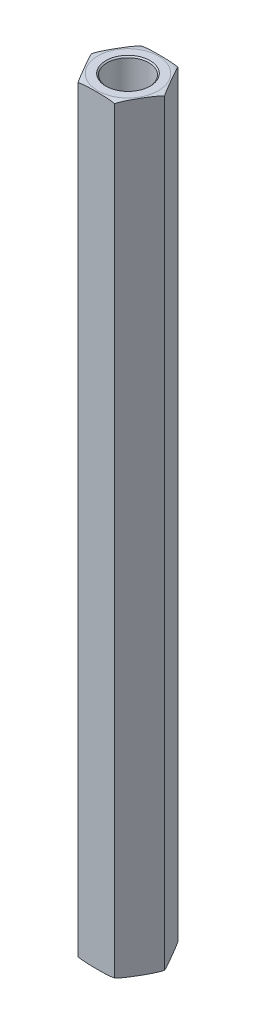
ISO-10303-21;
HEADER;
FILE_DESCRIPTION(('STEP AP214'),'2;1');
FILE_NAME('part.step','',(''),(''),'','','');
FILE_SCHEMA(('AUTOMOTIVE_DESIGN { 1 0 10303 214 1 1 1 1 }'));
ENDSEC;
DATA;
#1=APPLICATION_CONTEXT('core data for automotive mechanical design processes');
#2=APPLICATION_PROTOCOL_DEFINITION('international standard','automotive_design',2000,#1);
#3=PRODUCT_CONTEXT('',#1,'mechanical');
#4=PRODUCT('Part','Part','',(#3));
#5=PRODUCT_RELATED_PRODUCT_CATEGORY('part','',(#4));
#6=PRODUCT_DEFINITION_FORMATION('','',#4);
#7=PRODUCT_DEFINITION_CONTEXT('part definition',#1,'design');
#8=PRODUCT_DEFINITION('design','',#6,#7);
#9=PRODUCT_DEFINITION_SHAPE('','',#8);
#10=(LENGTH_UNIT() NAMED_UNIT(*) SI_UNIT(.MILLI.,.METRE.));
#11=(NAMED_UNIT(*) PLANE_ANGLE_UNIT() SI_UNIT($,.RADIAN.));
#12=(NAMED_UNIT(*) SI_UNIT($,.STERADIAN.) SOLID_ANGLE_UNIT());
#13=UNCERTAINTY_MEASURE_WITH_UNIT(LENGTH_MEASURE(1.E-05),#10,'distance_accuracy_value','');
#14=(GEOMETRIC_REPRESENTATION_CONTEXT(3) GLOBAL_UNCERTAINTY_ASSIGNED_CONTEXT((#13)) GLOBAL_UNIT_ASSIGNED_CONTEXT((#10,
#11,#12)) REPRESENTATION_CONTEXT('',''));
#15=CARTESIAN_POINT('',(0.,0.,0.));
#16=DIRECTION('',(0.,0.,1.));
#17=DIRECTION('',(1.,0.,0.));
#18=AXIS2_PLACEMENT_3D('',#15,#16,#17);
#19=CARTESIAN_POINT('',(0.,25.4,0.));
#20=DIRECTION('',(0.,1.,0.));
#21=DIRECTION('',(0.,0.,1.));
#22=AXIS2_PLACEMENT_3D('',#19,#20,#21);
#23=PLANE('',#22);
#24=CARTESIAN_POINT('',(0.,25.4,0.));
#25=DIRECTION('',(0.,1.,0.));
#26=DIRECTION('',(0.,0.,1.));
#27=AXIS2_PLACEMENT_3D('',#24,#25,#26);
#28=CIRCLE('',#27,2.0955);
#29=CARTESIAN_POINT('',(0.,25.4,2.0955));
#30=VERTEX_POINT('',#29);
#31=EDGE_CURVE('E302',#30,#30,#28,.T.);
#32=ORIENTED_EDGE('',*,*,#31,.T.);
#33=EDGE_LOOP('',(#32));
#34=FACE_BOUND('',#33,.T.);
#35=ADVANCED_FACE('F16',(#34),#23,.T.);
#36=CARTESIAN_POINT('',(0.,-25.4,0.));
#37=DIRECTION('',(0.,-1.,0.));
#38=DIRECTION('',(0.,0.,-1.));
#39=AXIS2_PLACEMENT_3D('',#36,#37,#38);
#40=PLANE('',#39);
#41=CARTESIAN_POINT('',(0.,-25.4,0.));
#42=DIRECTION('',(0.,-1.,0.));
#43=DIRECTION('',(0.,0.,-1.));
#44=AXIS2_PLACEMENT_3D('',#41,#42,#43);
#45=CIRCLE('',#44,2.0955);
#46=CARTESIAN_POINT('',(0.,-25.4,-2.0955));
#47=VERTEX_POINT('',#46);
#48=EDGE_CURVE('E312',#47,#47,#45,.T.);
#49=ORIENTED_EDGE('',*,*,#48,.T.);
#50=EDGE_LOOP('',(#49));
#51=FACE_BOUND('',#50,.T.);
#52=ADVANCED_FACE('F407',(#51),#40,.T.);
#53=CARTESIAN_POINT('',(0.,25.4,0.));
#54=DIRECTION('',(0.,1.,0.));
#55=DIRECTION('',(0.,0.,1.));
#56=AXIS2_PLACEMENT_3D('',#53,#54,#55);
#57=CYLINDRICAL_SURFACE('',#56,2.0955);
#58=CARTESIAN_POINT('',(0.,37.9730000000222,0.));
#59=DIRECTION('',(0.,1.,0.));
#60=DIRECTION('',(0.,0.,1.));
#61=AXIS2_PLACEMENT_3D('',#58,#59,#60);
#62=CIRCLE('',#61,2.09549999999581);
#63=CARTESIAN_POINT('',(0.,37.9730000000222,2.09549999999581));
#64=VERTEX_POINT('',#63);
#65=EDGE_CURVE('E314',#64,#64,#62,.T.);
#66=ORIENTED_EDGE('',*,*,#65,.T.);
#67=EDGE_LOOP('',(#66));
#68=FACE_BOUND('',#67,.T.);
#69=ORIENTED_EDGE('',*,*,#31,.F.);
#70=EDGE_LOOP('',(#69));
#71=FACE_BOUND('',#70,.T.);
#72=ADVANCED_FACE('F324',(#68,#71),#57,.F.);
#73=CARTESIAN_POINT('',(0.,-25.4,0.));
#74=DIRECTION('',(0.,-1.,0.));
#75=DIRECTION('',(0.,0.,-1.));
#76=AXIS2_PLACEMENT_3D('',#73,#74,#75);
#77=CYLINDRICAL_SURFACE('',#76,2.0955);
#78=ORIENTED_EDGE('',*,*,#48,.F.);
#79=EDGE_LOOP('',(#78));
#80=FACE_BOUND('',#79,.T.);
#81=CARTESIAN_POINT('',(0.,-37.9729999999654,0.));
#82=DIRECTION('',(0.,-1.,0.));
#83=DIRECTION('',(0.,0.,-1.));
#84=AXIS2_PLACEMENT_3D('',#81,#82,#83);
#85=CIRCLE('',#84,2.09549999999581);
#86=CARTESIAN_POINT('',(0.,-37.9729999999654,-2.09549999999581));
#87=VERTEX_POINT('',#86);
#88=EDGE_CURVE('E154',#87,#87,#85,.T.);
#89=ORIENTED_EDGE('',*,*,#88,.T.);
#90=EDGE_LOOP('',(#89));
#91=FACE_BOUND('',#90,.T.);
#92=ADVANCED_FACE('F329',(#80,#91),#77,.F.);
#93=CARTESIAN_POINT('',(0.,38.099999999929,0.));
#94=DIRECTION('',(0.,1.,0.));
#95=DIRECTION('',(0.,0.,1.));
#96=AXIS2_PLACEMENT_3D('',#93,#94,#95);
#97=CONICAL_SURFACE('',#96,2.22249999990254,0.785398163397448);
#98=CARTESIAN_POINT('',(0.,38.1000000000427,0.));
#99=DIRECTION('',(0.,1.,0.));
#100=DIRECTION('',(0.,0.,1.));
#101=AXIS2_PLACEMENT_3D('',#98,#99,#100);
#102=CIRCLE('',#101,2.22250000001623);
#103=CARTESIAN_POINT('',(0.,38.1000000000427,2.22250000001623));
#104=VERTEX_POINT('',#103);
#105=EDGE_CURVE('E79',#104,#104,#102,.T.);
#106=ORIENTED_EDGE('',*,*,#105,.T.);
#107=EDGE_LOOP('',(#106));
#108=FACE_BOUND('',#107,.T.);
#109=ORIENTED_EDGE('',*,*,#65,.F.);
#110=EDGE_LOOP('',(#109));
#111=FACE_BOUND('',#110,.T.);
#112=ADVANCED_FACE('F327',(#108,#111),#97,.F.);
#113=CARTESIAN_POINT('',(-3.66617420935413,38.1,0.));
#114=DIRECTION('',(0.866025403784439,0.,-0.499999999999999));
#115=DIRECTION('',(-0.499999999999999,0.,-0.866025403784439));
#116=AXIS2_PLACEMENT_3D('',#113,#114,#115);
#117=PLANE('',#116);
#118=DIRECTION('',(0.,1.,0.));
#119=VECTOR('',#118,1.);
#120=CARTESIAN_POINT('',(-1.83308710467708,38.1,3.175));
#121=LINE('',#120,#119);
#122=CARTESIAN_POINT('',(-1.83308710467708,-37.973,3.17499999999999));
#123=VERTEX_POINT('',#122);
#124=CARTESIAN_POINT('',(-1.83308710467706,37.973,3.175));
#125=VERTEX_POINT('',#124);
#126=EDGE_CURVE('E75',#123,#125,#121,.T.);
#127=ORIENTED_EDGE('',*,*,#126,.T.);
#128=CARTESIAN_POINT('',(-3.66617420935412,37.973,0.));
#129=CARTESIAN_POINT('',(-3.62797961467394,37.9889014148997,0.0661549785605816));
#130=CARTESIAN_POINT('',(-3.58956810864155,38.0024886076105,0.132685658603915));
#131=CARTESIAN_POINT('',(-3.51249051795707,38.0258161979402,0.266187961794431));
#132=CARTESIAN_POINT('',(-3.47382473049842,38.0355604771397,0.333159070187479));
#133=CARTESIAN_POINT('',(-3.39641631867867,38.0519966530451,0.467234372392503));
#134=CARTESIAN_POINT('',(-3.35767399633305,38.0586945328669,0.534338043098323));
#135=CARTESIAN_POINT('',(-3.28009834620104,38.0697767572932,0.668703010557154));
#136=CARTESIAN_POINT('',(-3.24126499587761,38.074160450474,0.735964346345458));
#137=CARTESIAN_POINT('',(-3.16354065964303,38.0812403004263,0.870586845688321));
#138=CARTESIAN_POINT('',(-3.12464965374463,38.0839355237591,0.937948043861809));
#139=CARTESIAN_POINT('',(-3.04685144594578,38.0881531983713,1.07269849250722));
#140=CARTESIAN_POINT('',(-3.00794424351953,38.0896756080272,1.14008774388984));
#141=CARTESIAN_POINT('',(-2.93051517598855,38.091922705889,1.27419882283618));
#142=CARTESIAN_POINT('',(-2.89199336248915,38.0926552468181,1.34092056101683));
#143=CARTESIAN_POINT('',(-2.81494778346123,38.0935767302574,1.47436741839176));
#144=CARTESIAN_POINT('',(-2.77642401791417,38.0937656658949,1.54109253761813));
#145=CARTESIAN_POINT('',(-2.69935964430989,38.0936659966806,1.67457194815423));
#146=CARTESIAN_POINT('',(-2.66081903631797,38.0933771811765,1.74132623935083));
#147=CARTESIAN_POINT('',(-2.58373908085303,38.092221986219,1.87483263846124));
#148=CARTESIAN_POINT('',(-2.54519973341218,38.0913555970386,1.94158474631935));
#149=CARTESIAN_POINT('',(-2.46812969629742,38.0887861940656,2.07507396634334));
#150=CARTESIAN_POINT('',(-2.42959900625935,38.0870832271616,2.14181107913996));
#151=CARTESIAN_POINT('',(-2.35255651340877,38.0824387229726,2.27525259109893));
#152=CARTESIAN_POINT('',(-2.3140447097541,38.0794972471358,2.34195699171993));
#153=CARTESIAN_POINT('',(-2.25084206239913,38.0732174124748,2.4514271881116));
#154=CARTESIAN_POINT('',(-2.2261384933698,38.0703980110463,2.49421502479868));
#155=CARTESIAN_POINT('',(-2.17676945272202,38.0638696794303,2.57972471152158));
#156=CARTESIAN_POINT('',(-2.15210397034159,38.0601610809139,2.62244658019767));
#157=CARTESIAN_POINT('',(-2.10282753811676,38.0516802711496,2.70779586442681));
#158=CARTESIAN_POINT('',(-2.07821657107511,38.0469084657008,2.75042330976635));
#159=CARTESIAN_POINT('',(-2.02900094683535,38.0360987712516,2.83566727147582));
#160=CARTESIAN_POINT('',(-2.00439646085451,38.0300577313084,2.87828349128876));
#161=CARTESIAN_POINT('',(-1.95527325900925,38.0165138354161,2.96336737271521));
#162=CARTESIAN_POINT('',(-1.93075459617607,38.0090101978029,3.00583494247592));
#163=CARTESIAN_POINT('',(-1.88182157373168,37.9923203507084,3.09058942351751));
#164=CARTESIAN_POINT('',(-1.85740744053269,37.9831314978033,3.13287594264093));
#165=CARTESIAN_POINT('',(-1.83308710467707,37.973,3.175));
#166=B_SPLINE_CURVE_WITH_KNOTS('',3,(#128,#129,#130,#131,#132,#133,#134,#135,#136,#137,#138,
#139,#140,#141,#142,#143,#144,#145,#146,#147,#148,#149,#150,#151,#152,#153,#154,#155,#156,#157,
#158,#159,#160,#161,#162,#163,#164,#165),.UNSPECIFIED.,.F.,.F.,(4,2,2,2,2,2,2,2,2,2,2,2,2,2,2,2,
2,2,4),(0.,0.233977307817999,0.467717675040806,0.700996973557669,0.934341903229975,
1.16781571967268,1.40129782179858,1.63243665809709,1.86357841666662,2.09482211846345,
2.32606971471551,2.55730435147459,2.7885275169448,2.93698369265143,3.08538458004518,
3.23372892334618,3.38244598546634,3.53124274626094,3.68027493713584),.UNSPECIFIED.);
#167=CARTESIAN_POINT('',(-3.66617420935412,37.973,0.));
#168=VERTEX_POINT('',#167);
#169=EDGE_CURVE('E68',#168,#125,#166,.T.);
#170=ORIENTED_EDGE('',*,*,#169,.F.);
#171=DIRECTION('',(0.,1.,0.));
#172=VECTOR('',#171,1.);
#173=CARTESIAN_POINT('',(-3.66617420935413,38.1,0.));
#174=LINE('',#173,#172);
#175=CARTESIAN_POINT('',(-3.66617420935413,-37.973,0.));
#176=VERTEX_POINT('',#175);
#177=EDGE_CURVE('E72',#168,#176,#174,.F.);
#178=ORIENTED_EDGE('',*,*,#177,.T.);
#179=CARTESIAN_POINT('',(-1.83308710467707,-37.973,3.17499999999999));
#180=CARTESIAN_POINT('',(-1.87128169935726,-37.9889014148997,3.10884502143941));
#181=CARTESIAN_POINT('',(-1.90969320538964,-38.0024886076105,3.04231434139608));
#182=CARTESIAN_POINT('',(-1.98677079607412,-38.0258161979402,2.90881203820556));
#183=CARTESIAN_POINT('',(-2.02543658353278,-38.0355604771397,2.84184092981252));
#184=CARTESIAN_POINT('',(-2.10284499535253,-38.0519966530451,2.70776562760749));
#185=CARTESIAN_POINT('',(-2.14158731769815,-38.0586945328669,2.64066195690167));
#186=CARTESIAN_POINT('',(-2.21916296783016,-38.0697767572932,2.50629698944284));
#187=CARTESIAN_POINT('',(-2.25799631815359,-38.074160450474,2.43903565365454));
#188=CARTESIAN_POINT('',(-2.33572065438817,-38.0812403004263,2.30441315431167));
#189=CARTESIAN_POINT('',(-2.37461166028657,-38.0839355237591,2.23705195613819));
#190=CARTESIAN_POINT('',(-2.45240986808542,-38.0881531983713,2.10230150749278));
#191=CARTESIAN_POINT('',(-2.49131707051166,-38.0896756080272,2.03491225611015));
#192=CARTESIAN_POINT('',(-2.56874613804264,-38.091922705889,1.90080117716381));
#193=CARTESIAN_POINT('',(-2.60726795154204,-38.0926552468181,1.83407943898316));
#194=CARTESIAN_POINT('',(-2.68431353056997,-38.0935767302574,1.70063258160823));
#195=CARTESIAN_POINT('',(-2.72283729611702,-38.0937656658949,1.63390746238186));
#196=CARTESIAN_POINT('',(-2.79990166972131,-38.0936659966806,1.50042805184577));
#197=CARTESIAN_POINT('',(-2.83844227771323,-38.0933771811765,1.43367376064917));
#198=CARTESIAN_POINT('',(-2.91552223317816,-38.092221986219,1.30016736153875));
#199=CARTESIAN_POINT('',(-2.95406158061902,-38.0913555970386,1.23341525368064));
#200=CARTESIAN_POINT('',(-3.03113161773378,-38.0887861940656,1.09992603365665));
#201=CARTESIAN_POINT('',(-3.06966230777185,-38.0870832271616,1.03318892086004));
#202=CARTESIAN_POINT('',(-3.14670480062243,-38.0824387229726,0.899747408901061));
#203=CARTESIAN_POINT('',(-3.1852166042771,-38.0794972471358,0.833043008280059));
#204=CARTESIAN_POINT('',(-3.24841925163207,-38.0732174124748,0.723572811888393));
#205=CARTESIAN_POINT('',(-3.27312282066139,-38.0703980110463,0.680784975201311));
#206=CARTESIAN_POINT('',(-3.32249186130918,-38.0638696794303,0.595275288478418));
#207=CARTESIAN_POINT('',(-3.3471573436896,-38.0601610809139,0.552553419802327));
#208=CARTESIAN_POINT('',(-3.39643377591444,-38.0516802711496,0.467204135573185));
#209=CARTESIAN_POINT('',(-3.42104474295609,-38.0469084657008,0.424576690233643));
#210=CARTESIAN_POINT('',(-3.47026036719584,-38.0360987712516,0.339332728524168));
#211=CARTESIAN_POINT('',(-3.49486485317669,-38.0300577313084,0.296716508711231));
#212=CARTESIAN_POINT('',(-3.54398805502195,-38.0165138354161,0.211632627284777));
#213=CARTESIAN_POINT('',(-3.56850671785512,-38.0090101978029,0.169165057524069));
#214=CARTESIAN_POINT('',(-3.61743974029951,-37.9923203507084,0.0844105764824764));
#215=CARTESIAN_POINT('',(-3.64185387349851,-37.9831314978033,0.0421240573590603));
#216=CARTESIAN_POINT('',(-3.66617420935413,-37.973,0.));
#217=B_SPLINE_CURVE_WITH_KNOTS('',3,(#179,#180,#181,#182,#183,#184,#185,#186,#187,#188,#189,
#190,#191,#192,#193,#194,#195,#196,#197,#198,#199,#200,#201,#202,#203,#204,#205,#206,#207,#208,
#209,#210,#211,#212,#213,#214,#215,#216),.UNSPECIFIED.,.F.,.F.,(4,2,2,2,2,2,2,2,2,2,2,2,2,2,2,2,
2,2,4),(0.,0.233977307817998,0.467717675040806,0.700996973557669,0.934341903229975,
1.16781571967268,1.40129782179858,1.63243665809709,1.86357841666662,2.09482211846345,
2.32606971471551,2.55730435147459,2.7885275169448,2.93698369265143,3.08538458004518,
3.23372892334618,3.38244598546635,3.53124274626094,3.68027493713584),.UNSPECIFIED.);
#218=EDGE_CURVE('E87',#123,#176,#217,.T.);
#219=ORIENTED_EDGE('',*,*,#218,.F.);
#220=EDGE_LOOP('',(#127,#170,#178,#219));
#221=FACE_BOUND('',#220,.T.);
#222=ADVANCED_FACE('F70',(#221),#117,.F.);
#223=CARTESIAN_POINT('',(0.,-38.0999999998153,0.));
#224=DIRECTION('',(0.,-1.,0.));
#225=DIRECTION('',(0.,0.,-1.));
#226=AXIS2_PLACEMENT_3D('',#223,#224,#225);
#227=CONICAL_SURFACE('',#226,2.2224999998457,0.785398163397448);
#228=ORIENTED_EDGE('',*,*,#88,.F.);
#229=EDGE_LOOP('',(#228));
#230=FACE_BOUND('',#229,.T.);
#231=CARTESIAN_POINT('',(0.,-38.099999999929,0.));
#232=DIRECTION('',(0.,-1.,0.));
#233=DIRECTION('',(0.,0.,-1.));
#234=AXIS2_PLACEMENT_3D('',#231,#232,#233);
#235=CIRCLE('',#234,2.22249999995938);
#236=CARTESIAN_POINT('',(0.,-38.099999999929,-2.22249999995938));
#237=VERTEX_POINT('',#236);
#238=EDGE_CURVE('E278',#237,#237,#235,.F.);
#239=ORIENTED_EDGE('',*,*,#238,.F.);
#240=EDGE_LOOP('',(#239));
#241=FACE_BOUND('',#240,.T.);
#242=ADVANCED_FACE('F336',(#230,#241),#227,.F.);
#243=CARTESIAN_POINT('',(-1.83308710467707,38.1,-3.175));
#244=DIRECTION('',(0.,-1.,0.));
#245=DIRECTION('',(0.,0.,-1.));
#246=AXIS2_PLACEMENT_3D('',#243,#244,#245);
#247=PLANE('',#246);
#248=CARTESIAN_POINT('',(0.,38.1,0.));
#249=DIRECTION('',(0.,-1.,0.));
#250=DIRECTION('',(0.,0.,1.));
#251=AXIS2_PLACEMENT_3D('',#248,#249,#250);
#252=CIRCLE('',#251,3.03117420935412);
#253=CARTESIAN_POINT('',(0.,38.1,3.03117420935411));
#254=VERTEX_POINT('',#253);
#255=CARTESIAN_POINT('',(0.,38.1,-3.03117420935411));
#256=VERTEX_POINT('',#255);
#257=EDGE_CURVE('E78',#254,#256,#252,.T.);
#258=ORIENTED_EDGE('',*,*,#257,.F.);
#259=CARTESIAN_POINT('',(0.,38.1,0.));
#260=DIRECTION('',(0.,-1.,0.));
#261=DIRECTION('',(0.,0.,-1.));
#262=AXIS2_PLACEMENT_3D('',#259,#260,#261);
#263=CIRCLE('',#262,3.03117420935412);
#264=EDGE_CURVE('E139',#256,#254,#263,.T.);
#265=ORIENTED_EDGE('',*,*,#264,.F.);
#266=EDGE_LOOP('',(#258,#265));
#267=FACE_BOUND('',#266,.T.);
#268=ORIENTED_EDGE('',*,*,#105,.F.);
#269=EDGE_LOOP('',(#268));
#270=FACE_BOUND('',#269,.T.);
#271=ADVANCED_FACE('F115',(#267,#270),#247,.F.);
#272=CARTESIAN_POINT('',(-1.83308710467707,38.1,-3.175));
#273=DIRECTION('',(0.866025403784439,0.,0.5));
#274=DIRECTION('',(0.5,0.,-0.866025403784439));
#275=AXIS2_PLACEMENT_3D('',#272,#273,#274);
#276=PLANE('',#275);
#277=ORIENTED_EDGE('',*,*,#177,.F.);
#278=CARTESIAN_POINT('',(-1.83308710467706,37.973,-3.17500000000001));
#279=CARTESIAN_POINT('',(-1.87128169935724,37.9889014148997,-3.10884502143944));
#280=CARTESIAN_POINT('',(-1.90969320538963,38.0024886076105,-3.04231434139611));
#281=CARTESIAN_POINT('',(-1.98677079607411,38.0258161979402,-2.90881203820559));
#282=CARTESIAN_POINT('',(-2.02543658353276,38.0355604771397,-2.84184092981255));
#283=CARTESIAN_POINT('',(-2.10284499535251,38.0519966530451,-2.70776562760753));
#284=CARTESIAN_POINT('',(-2.14158731769812,38.0586945328669,-2.64066195690171));
#285=CARTESIAN_POINT('',(-2.21916296783013,38.0697767572932,-2.50629698944289));
#286=CARTESIAN_POINT('',(-2.25799631815356,38.074160450474,-2.43903565365458));
#287=CARTESIAN_POINT('',(-2.33572065438814,38.0812403004263,-2.30441315431172));
#288=CARTESIAN_POINT('',(-2.37461166028654,38.0839355237591,-2.23705195613824));
#289=CARTESIAN_POINT('',(-2.45240986808539,38.0881531983713,-2.10230150749283));
#290=CARTESIAN_POINT('',(-2.49131707051163,38.0896756080272,-2.03491225611021));
#291=CARTESIAN_POINT('',(-2.56874613804261,38.091922705889,-1.90080117716388));
#292=CARTESIAN_POINT('',(-2.607267951542,38.0926552468181,-1.83407943898323));
#293=CARTESIAN_POINT('',(-2.68431353056993,38.0935767302574,-1.7006325816083));
#294=CARTESIAN_POINT('',(-2.72283729611698,38.0937656658949,-1.63390746238193));
#295=CARTESIAN_POINT('',(-2.79990166972127,38.0936659966806,-1.50042805184584));
#296=CARTESIAN_POINT('',(-2.83844227771318,38.0933771811765,-1.43367376064925));
#297=CARTESIAN_POINT('',(-2.91552223317812,38.092221986219,-1.30016736153884));
#298=CARTESIAN_POINT('',(-2.95406158061897,38.0913555970386,-1.23341525368073));
#299=CARTESIAN_POINT('',(-3.03113161773373,38.0887861940656,-1.09992603365674));
#300=CARTESIAN_POINT('',(-3.0696623077718,38.0870832271616,-1.03318892086013));
#301=CARTESIAN_POINT('',(-3.14670480062238,38.0824387229726,-0.899747408901157));
#302=CARTESIAN_POINT('',(-3.18521660427705,38.0794972471358,-0.833043008280158));
#303=CARTESIAN_POINT('',(-3.24841925163202,38.0732174124748,-0.723572811888488));
#304=CARTESIAN_POINT('',(-3.27312282066135,38.0703980110463,-0.6807849752014));
#305=CARTESIAN_POINT('',(-3.32249186130914,38.0638696794303,-0.595275288478496));
#306=CARTESIAN_POINT('',(-3.34715734368956,38.0601610809139,-0.5525534198024));
#307=CARTESIAN_POINT('',(-3.39643377591441,38.0516802711496,-0.467204135573248));
#308=CARTESIAN_POINT('',(-3.42104474295606,38.0469084657008,-0.424576690233701));
#309=CARTESIAN_POINT('',(-3.47026036719582,38.0360987712516,-0.339332728524217));
#310=CARTESIAN_POINT('',(-3.49486485317667,38.0300577313084,-0.296716508711274));
#311=CARTESIAN_POINT('',(-3.54398805502194,38.0165138354161,-0.21163262728481));
#312=CARTESIAN_POINT('',(-3.56850671785511,38.0090101978029,-0.169165057524097));
#313=CARTESIAN_POINT('',(-3.61743974029951,37.9923203507084,-0.0844105764824943));
#314=CARTESIAN_POINT('',(-3.64185387349851,37.9831314978033,-0.0421240573590734));
#315=CARTESIAN_POINT('',(-3.66617420935413,37.973,0.));
#316=B_SPLINE_CURVE_WITH_KNOTS('',3,(#278,#279,#280,#281,#282,#283,#284,#285,#286,#287,#288,
#289,#290,#291,#292,#293,#294,#295,#296,#297,#298,#299,#300,#301,#302,#303,#304,#305,#306,#307,
#308,#309,#310,#311,#312,#313,#314,#315),.UNSPECIFIED.,.F.,.F.,(4,2,2,2,2,2,2,2,2,2,2,2,2,2,2,2,
2,2,4),(0.,0.233977307817992,0.467717675040792,0.700996973557648,0.934341903229947,
1.16781571967264,1.40129782179854,1.63243665809704,1.86357841666656,2.09482211846338,
2.32606971471544,2.55730435147451,2.78852751694472,2.93698369265136,3.08538458004513,
3.23372892334615,3.38244598546633,3.53124274626095,3.68027493713586),.UNSPECIFIED.);
#317=CARTESIAN_POINT('',(-1.83308710467705,37.973,-3.17500000000001));
#318=VERTEX_POINT('',#317);
#319=EDGE_CURVE('E84',#318,#168,#316,.T.);
#320=ORIENTED_EDGE('',*,*,#319,.F.);
#321=DIRECTION('',(0.,1.,0.));
#322=VECTOR('',#321,1.);
#323=CARTESIAN_POINT('',(-1.83308710467705,38.1,-3.175));
#324=LINE('',#323,#322);
#325=CARTESIAN_POINT('',(-1.83308710467707,-37.973,-3.175));
#326=VERTEX_POINT('',#325);
#327=EDGE_CURVE('E177',#318,#326,#324,.F.);
#328=ORIENTED_EDGE('',*,*,#327,.T.);
#329=CARTESIAN_POINT('',(-3.66617420935413,-37.973,0.));
#330=CARTESIAN_POINT('',(-3.62797961467395,-37.9889014148997,-0.0661549785605743));
#331=CARTESIAN_POINT('',(-3.58956810864156,-38.0024886076105,-0.132685658603907));
#332=CARTESIAN_POINT('',(-3.51249051795708,-38.0258161979402,-0.266187961794421));
#333=CARTESIAN_POINT('',(-3.47382473049843,-38.0355604771397,-0.333159070187467));
#334=CARTESIAN_POINT('',(-3.39641631867868,-38.0519966530451,-0.467234372392488));
#335=CARTESIAN_POINT('',(-3.35767399633306,-38.0586945328669,-0.534338043098307));
#336=CARTESIAN_POINT('',(-3.28009834620105,-38.0697767572932,-0.668703010557135));
#337=CARTESIAN_POINT('',(-3.24126499587762,-38.074160450474,-0.735964346345438));
#338=CARTESIAN_POINT('',(-3.16354065964304,-38.0812403004263,-0.870586845688298));
#339=CARTESIAN_POINT('',(-3.12464965374464,-38.0839355237591,-0.937948043861785));
#340=CARTESIAN_POINT('',(-3.0468514459458,-38.0881531983713,-1.07269849250719));
#341=CARTESIAN_POINT('',(-3.00794424351955,-38.0896756080272,-1.14008774388981));
#342=CARTESIAN_POINT('',(-2.93051517598857,-38.091922705889,-1.27419882283615));
#343=CARTESIAN_POINT('',(-2.89199336248918,-38.0926552468181,-1.3409205610168));
#344=CARTESIAN_POINT('',(-2.81494778346125,-38.0935767302574,-1.47436741839173));
#345=CARTESIAN_POINT('',(-2.7764240179142,-38.0937656658949,-1.5410925376181));
#346=CARTESIAN_POINT('',(-2.69935964430991,-38.0936659966806,-1.67457194815419));
#347=CARTESIAN_POINT('',(-2.66081903631799,-38.0933771811765,-1.74132623935079));
#348=CARTESIAN_POINT('',(-2.58373908085306,-38.092221986219,-1.8748326384612));
#349=CARTESIAN_POINT('',(-2.54519973341221,-38.0913555970386,-1.94158474631931));
#350=CARTESIAN_POINT('',(-2.46812969629744,-38.0887861940656,-2.0750739663433));
#351=CARTESIAN_POINT('',(-2.42959900625938,-38.0870832271616,-2.14181107913991));
#352=CARTESIAN_POINT('',(-2.35255651340879,-38.0824387229726,-2.27525259109889));
#353=CARTESIAN_POINT('',(-2.31404470975413,-38.0794972471358,-2.34195699171989));
#354=CARTESIAN_POINT('',(-2.25084206239916,-38.0732174124748,-2.45142718811155));
#355=CARTESIAN_POINT('',(-2.22613849336983,-38.0703980110463,-2.49421502479864));
#356=CARTESIAN_POINT('',(-2.17676945272204,-38.0638696794303,-2.57972471152153));
#357=CARTESIAN_POINT('',(-2.15210397034162,-38.0601610809139,-2.62244658019763));
#358=CARTESIAN_POINT('',(-2.10282753811678,-38.0516802711496,-2.70779586442677));
#359=CARTESIAN_POINT('',(-2.07821657107513,-38.0469084657008,-2.75042330976632));
#360=CARTESIAN_POINT('',(-2.02900094683537,-38.0360987712516,-2.8356672714758));
#361=CARTESIAN_POINT('',(-2.00439646085452,-38.0300577313084,-2.87828349128874));
#362=CARTESIAN_POINT('',(-1.95527325900926,-38.0165138354161,-2.96336737271519));
#363=CARTESIAN_POINT('',(-1.93075459617608,-38.0090101978029,-3.0058349424759));
#364=CARTESIAN_POINT('',(-1.88182157373169,-37.9923203507084,-3.0905894235175));
#365=CARTESIAN_POINT('',(-1.85740744053269,-37.9831314978033,-3.13287594264092));
#366=CARTESIAN_POINT('',(-1.83308710467707,-37.973,-3.17499999999999));
#367=B_SPLINE_CURVE_WITH_KNOTS('',3,(#329,#330,#331,#332,#333,#334,#335,#336,#337,#338,#339,
#340,#341,#342,#343,#344,#345,#346,#347,#348,#349,#350,#351,#352,#353,#354,#355,#356,#357,#358,
#359,#360,#361,#362,#363,#364,#365,#366),.UNSPECIFIED.,.F.,.F.,(4,2,2,2,2,2,2,2,2,2,2,2,2,2,2,2,
2,2,4),(0.,0.233977307817996,0.467717675040799,0.700996973557657,0.934341903229959,
1.16781571967266,1.40129782179856,1.63243665809706,1.86357841666659,2.09482211846341,
2.32606971471547,2.55730435147455,2.78852751694475,2.93698369265139,3.08538458004515,
3.23372892334615,3.38244598546633,3.53124274626093,3.68027493713584),.UNSPECIFIED.);
#368=EDGE_CURVE('E86',#176,#326,#367,.T.);
#369=ORIENTED_EDGE('',*,*,#368,.F.);
#370=EDGE_LOOP('',(#277,#320,#328,#369));
#371=FACE_BOUND('',#370,.T.);
#372=ADVANCED_FACE('F82',(#371),#276,.F.);
#373=CARTESIAN_POINT('',(-1.83308710467707,38.1,3.175));
#374=DIRECTION('',(0.,0.,-1.));
#375=DIRECTION('',(-1.,0.,0.));
#376=AXIS2_PLACEMENT_3D('',#373,#374,#375);
#377=PLANE('',#376);
#378=DIRECTION('',(0.,1.,0.));
#379=VECTOR('',#378,1.);
#380=CARTESIAN_POINT('',(1.83308710467706,38.1,3.17499999999999));
#381=LINE('',#380,#379);
#382=CARTESIAN_POINT('',(1.83308710467706,-37.973,3.17499999999999));
#383=VERTEX_POINT('',#382);
#384=CARTESIAN_POINT('',(1.83308710467706,37.973,3.17499999999999));
#385=VERTEX_POINT('',#384);
#386=EDGE_CURVE('E179',#383,#385,#381,.T.);
#387=ORIENTED_EDGE('',*,*,#386,.T.);
#388=CARTESIAN_POINT('',(-1.83308710467706,37.973,3.175));
#389=CARTESIAN_POINT('',(-1.73237579828683,37.9939400141518,3.175));
#390=CARTESIAN_POINT('',(-1.63096506893486,38.0108853495327,3.175));
#391=CARTESIAN_POINT('',(-1.42767146651469,38.0384971643984,3.175));
#392=CARTESIAN_POINT('',(-1.32579191427254,38.0491875658753,3.175));
#393=CARTESIAN_POINT('',(-1.12177634709138,38.0661280408079,3.175));
#394=CARTESIAN_POINT('',(-1.0196405664338,38.0723812707189,3.175));
#395=CARTESIAN_POINT('',(-0.815663681397376,38.0819028064183,3.175));
#396=CARTESIAN_POINT('',(-0.713823115514574,38.0851834044999,3.175));
#397=CARTESIAN_POINT('',(-0.510018485441651,38.0899454848703,3.175));
#398=CARTESIAN_POINT('',(-0.408054390577977,38.0914254100882,3.175));
#399=CARTESIAN_POINT('',(-0.20406020033787,38.0933146818379,3.175));
#400=CARTESIAN_POINT('',(-0.102030100168935,38.0937234241492,3.175));
#401=CARTESIAN_POINT('',(0.102030100168936,38.0937234241492,3.175));
#402=CARTESIAN_POINT('',(0.204060200337871,38.0933146818379,3.17499999999999));
#403=CARTESIAN_POINT('',(0.408054390577979,38.0914254100882,3.17499999999999));
#404=CARTESIAN_POINT('',(0.510018485441654,38.0899454848703,3.17499999999999));
#405=CARTESIAN_POINT('',(0.713823115514577,38.0851834044999,3.17499999999999));
#406=CARTESIAN_POINT('',(0.81566368139738,38.0819028064183,3.17499999999999));
#407=CARTESIAN_POINT('',(1.0196405664338,38.0723812707189,3.17499999999999));
#408=CARTESIAN_POINT('',(1.12177634709138,38.0661280408079,3.17499999999999));
#409=CARTESIAN_POINT('',(1.32579191427255,38.0491875658753,3.17499999999999));
#410=CARTESIAN_POINT('',(1.4276714665147,38.0384971643984,3.17499999999999));
#411=CARTESIAN_POINT('',(1.63096506893487,38.0108853495327,3.17499999999999));
#412=CARTESIAN_POINT('',(1.73237579828684,37.9939400141518,3.17499999999999));
#413=CARTESIAN_POINT('',(1.83308710467707,37.973,3.17499999999999));
#414=B_SPLINE_CURVE_WITH_KNOTS('',3,(#388,#389,#390,#391,#392,#393,#394,#395,#396,#397,#398,
#399,#400,#401,#402,#403,#404,#405,#406,#407,#408,#409,#410,#411,#412,#413),.UNSPECIFIED.,.F.,
.F.,(4,2,2,2,2,2,2,2,2,2,2,2,4),(0.,0.308333242342807,0.615479423308236,0.922406891130009,
1.2280592962085,1.53397581645216,1.84006485747889,2.14615389850562,2.45207041874928,
2.75772282382777,3.06465029164955,3.37179647261497,3.68012971495778),.UNSPECIFIED.);
#415=EDGE_CURVE('E273',#125,#385,#414,.T.);
#416=ORIENTED_EDGE('',*,*,#415,.F.);
#417=ORIENTED_EDGE('',*,*,#126,.F.);
#418=CARTESIAN_POINT('',(1.83308710467706,-37.973,3.17499999999999));
#419=CARTESIAN_POINT('',(1.73237579828684,-37.9939400141518,3.17499999999999));
#420=CARTESIAN_POINT('',(1.63096506893486,-38.0108853495327,3.17499999999999));
#421=CARTESIAN_POINT('',(1.4276714665147,-38.0384971643984,3.17499999999999));
#422=CARTESIAN_POINT('',(1.32579191427254,-38.0491875658753,3.17499999999999));
#423=CARTESIAN_POINT('',(1.12177634709138,-38.0661280408079,3.17499999999999));
#424=CARTESIAN_POINT('',(1.0196405664338,-38.0723812707189,3.17499999999999));
#425=CARTESIAN_POINT('',(0.815663681397379,-38.0819028064183,3.17499999999999));
#426=CARTESIAN_POINT('',(0.713823115514575,-38.0851834044999,3.17499999999999));
#427=CARTESIAN_POINT('',(0.510018485441653,-38.0899454848703,3.17499999999999));
#428=CARTESIAN_POINT('',(0.408054390577978,-38.0914254100882,3.17499999999999));
#429=CARTESIAN_POINT('',(0.204060200337871,-38.0933146818379,3.17499999999999));
#430=CARTESIAN_POINT('',(0.102030100168936,-38.0937234241492,3.175));
#431=CARTESIAN_POINT('',(-0.102030100168936,-38.0937234241492,3.175));
#432=CARTESIAN_POINT('',(-0.204060200337873,-38.0933146818379,3.175));
#433=CARTESIAN_POINT('',(-0.408054390577981,-38.0914254100882,3.175));
#434=CARTESIAN_POINT('',(-0.510018485441657,-38.0899454848703,3.175));
#435=CARTESIAN_POINT('',(-0.713823115514581,-38.0851834044999,3.175));
#436=CARTESIAN_POINT('',(-0.815663681397385,-38.0819028064183,3.175));
#437=CARTESIAN_POINT('',(-1.01964056643381,-38.0723812707189,3.175));
#438=CARTESIAN_POINT('',(-1.12177634709139,-38.0661280408079,3.175));
#439=CARTESIAN_POINT('',(-1.32579191427255,-38.0491875658753,3.175));
#440=CARTESIAN_POINT('',(-1.42767146651471,-38.0384971643984,3.175));
#441=CARTESIAN_POINT('',(-1.63096506893487,-38.0108853495327,3.175));
#442=CARTESIAN_POINT('',(-1.73237579828685,-37.9939400141518,3.175));
#443=CARTESIAN_POINT('',(-1.83308710467708,-37.973,3.175));
#444=B_SPLINE_CURVE_WITH_KNOTS('',3,(#418,#419,#420,#421,#422,#423,#424,#425,#426,#427,#428,
#429,#430,#431,#432,#433,#434,#435,#436,#437,#438,#439,#440,#441,#442,#443),.UNSPECIFIED.,.F.,
.F.,(4,2,2,2,2,2,2,2,2,2,2,2,4),(0.,0.308333242342808,0.615479423308237,0.922406891130011,
1.2280592962085,1.53397581645216,1.84006485747889,2.14615389850562,2.45207041874929,
2.75772282382778,3.06465029164956,3.37179647261499,3.6801297149578),.UNSPECIFIED.);
#445=EDGE_CURVE('E250',#383,#123,#444,.T.);
#446=ORIENTED_EDGE('',*,*,#445,.F.);
#447=EDGE_LOOP('',(#387,#416,#417,#446));
#448=FACE_BOUND('',#447,.T.);
#449=ADVANCED_FACE('F203',(#448),#377,.F.);
#450=CARTESIAN_POINT('',(-1.83308710467707,-38.1,-3.175));
#451=DIRECTION('',(0.,-1.,0.));
#452=DIRECTION('',(0.,0.,-1.));
#453=AXIS2_PLACEMENT_3D('',#450,#451,#452);
#454=PLANE('',#453);
#455=CARTESIAN_POINT('',(0.,-38.1,0.));
#456=DIRECTION('',(0.,1.,0.));
#457=DIRECTION('',(0.,0.,1.));
#458=AXIS2_PLACEMENT_3D('',#455,#456,#457);
#459=CIRCLE('',#458,3.0311742093541);
#460=CARTESIAN_POINT('',(0.,-38.1,3.03117420935411));
#461=VERTEX_POINT('',#460);
#462=CARTESIAN_POINT('',(0.,-38.1,-3.03117420935411));
#463=VERTEX_POINT('',#462);
#464=EDGE_CURVE('E189',#461,#463,#459,.T.);
#465=ORIENTED_EDGE('',*,*,#464,.F.);
#466=CARTESIAN_POINT('',(0.,-38.1,0.));
#467=DIRECTION('',(0.,1.,0.));
#468=DIRECTION('',(0.,0.,-1.));
#469=AXIS2_PLACEMENT_3D('',#466,#467,#468);
#470=CIRCLE('',#469,3.0311742093541);
#471=EDGE_CURVE('E182',#461,#463,#470,.F.);
#472=ORIENTED_EDGE('',*,*,#471,.T.);
#473=EDGE_LOOP('',(#465,#472));
#474=FACE_BOUND('',#473,.T.);
#475=ORIENTED_EDGE('',*,*,#238,.T.);
#476=EDGE_LOOP('',(#475));
#477=FACE_BOUND('',#476,.T.);
#478=ADVANCED_FACE('F194',(#474,#477),#454,.T.);
#479=CARTESIAN_POINT('',(1.83308710467706,38.1,3.17499999999999));
#480=DIRECTION('',(-0.866025403784439,0.,-0.5));
#481=DIRECTION('',(-0.5,0.,0.866025403784439));
#482=AXIS2_PLACEMENT_3D('',#479,#480,#481);
#483=PLANE('',#482);
#484=DIRECTION('',(0.,1.,0.));
#485=VECTOR('',#484,1.);
#486=CARTESIAN_POINT('',(3.66617420935412,38.1,0.));
#487=LINE('',#486,#485);
#488=CARTESIAN_POINT('',(3.66617420935412,-37.973,0.));
#489=VERTEX_POINT('',#488);
#490=CARTESIAN_POINT('',(3.66617420935412,37.973,0.));
#491=VERTEX_POINT('',#490);
#492=EDGE_CURVE('E235',#489,#491,#487,.T.);
#493=ORIENTED_EDGE('',*,*,#492,.T.);
#494=CARTESIAN_POINT('',(1.83308710467706,37.973,3.17499999999999));
#495=CARTESIAN_POINT('',(1.87128169935725,37.9889014148997,3.10884502143942));
#496=CARTESIAN_POINT('',(1.90969320538963,38.0024886076105,3.04231434139608));
#497=CARTESIAN_POINT('',(1.98677079607411,38.0258161979402,2.90881203820557));
#498=CARTESIAN_POINT('',(2.02543658353277,38.0355604771397,2.84184092981252));
#499=CARTESIAN_POINT('',(2.10284499535252,38.0519966530451,2.7077656276075));
#500=CARTESIAN_POINT('',(2.14158731769813,38.0586945328669,2.64066195690167));
#501=CARTESIAN_POINT('',(2.21916296783015,38.0697767572932,2.50629698944284));
#502=CARTESIAN_POINT('',(2.25799631815358,38.074160450474,2.43903565365454));
#503=CARTESIAN_POINT('',(2.33572065438816,38.0812403004263,2.30441315431168));
#504=CARTESIAN_POINT('',(2.37461166028656,38.0839355237591,2.23705195613819));
#505=CARTESIAN_POINT('',(2.45240986808541,38.0881531983713,2.10230150749278));
#506=CARTESIAN_POINT('',(2.49131707051165,38.0896756080272,2.03491225611015));
#507=CARTESIAN_POINT('',(2.56874613804263,38.091922705889,1.90080117716381));
#508=CARTESIAN_POINT('',(2.60726795154203,38.0926552468181,1.83407943898317));
#509=CARTESIAN_POINT('',(2.68431353056996,38.0935767302574,1.70063258160823));
#510=CARTESIAN_POINT('',(2.72283729611701,38.0937656658949,1.63390746238186));
#511=CARTESIAN_POINT('',(2.7999016697213,38.0936659966806,1.50042805184577));
#512=CARTESIAN_POINT('',(2.83844227771322,38.0933771811765,1.43367376064917));
#513=CARTESIAN_POINT('',(2.91552223317815,38.092221986219,1.30016736153876));
#514=CARTESIAN_POINT('',(2.95406158061901,38.0913555970386,1.23341525368065));
#515=CARTESIAN_POINT('',(3.03113161773377,38.0887861940656,1.09992603365665));
#516=CARTESIAN_POINT('',(3.06966230777184,38.0870832271616,1.03318892086004));
#517=CARTESIAN_POINT('',(3.14670480062242,38.0824387229726,0.899747408901064));
#518=CARTESIAN_POINT('',(3.18521660427709,38.0794972471358,0.833043008280063));
#519=CARTESIAN_POINT('',(3.24841925163206,38.0732174124748,0.723572811888397));
#520=CARTESIAN_POINT('',(3.27312282066139,38.0703980110463,0.680784975201316));
#521=CARTESIAN_POINT('',(3.32249186130917,38.0638696794303,0.595275288478424));
#522=CARTESIAN_POINT('',(3.34715734368959,38.0601610809139,0.552553419802334));
#523=CARTESIAN_POINT('',(3.39643377591443,38.0516802711496,0.467204135573193));
#524=CARTESIAN_POINT('',(3.42104474295608,38.0469084657008,0.424576690233652));
#525=CARTESIAN_POINT('',(3.47026036719584,38.0360987712516,0.339332728524179));
#526=CARTESIAN_POINT('',(3.49486485317668,38.0300577313084,0.296716508711242));
#527=CARTESIAN_POINT('',(3.54398805502194,38.0165138354161,0.211632627284788));
#528=CARTESIAN_POINT('',(3.56850671785511,38.0090101978029,0.16916505752408));
#529=CARTESIAN_POINT('',(3.6174397402995,37.9923203507084,0.0844105764824873));
#530=CARTESIAN_POINT('',(3.6418538734985,37.9831314978033,0.042124057359072));
#531=CARTESIAN_POINT('',(3.66617420935412,37.973,0.));
#532=B_SPLINE_CURVE_WITH_KNOTS('',3,(#494,#495,#496,#497,#498,#499,#500,#501,#502,#503,#504,
#505,#506,#507,#508,#509,#510,#511,#512,#513,#514,#515,#516,#517,#518,#519,#520,#521,#522,#523,
#524,#525,#526,#527,#528,#529,#530,#531),.UNSPECIFIED.,.F.,.F.,(4,2,2,2,2,2,2,2,2,2,2,2,2,2,2,2,
2,2,4),(0.,0.233977307817998,0.467717675040805,0.700996973557669,0.934341903229977,
1.16781571967268,1.40129782179859,1.63243665809709,1.86357841666662,2.09482211846345,
2.32606971471551,2.5573043514746,2.7885275169448,2.93698369265143,3.08538458004518,
3.23372892334618,3.38244598546634,3.53124274626094,3.68027493713583),.UNSPECIFIED.);
#533=EDGE_CURVE('E268',#385,#491,#532,.T.);
#534=ORIENTED_EDGE('',*,*,#533,.F.);
#535=ORIENTED_EDGE('',*,*,#386,.F.);
#536=CARTESIAN_POINT('',(3.66617420935412,-37.973,0.));
#537=CARTESIAN_POINT('',(3.62797961467393,-37.9889014148997,0.0661549785605814));
#538=CARTESIAN_POINT('',(3.58956810864155,-38.0024886076105,0.132685658603915));
#539=CARTESIAN_POINT('',(3.51249051795707,-38.0258161979402,0.266187961794432));
#540=CARTESIAN_POINT('',(3.47382473049841,-38.0355604771397,0.33315907018748));
#541=CARTESIAN_POINT('',(3.39641631867866,-38.0519966530451,0.467234372392504));
#542=CARTESIAN_POINT('',(3.35767399633305,-38.0586945328669,0.534338043098324));
#543=CARTESIAN_POINT('',(3.28009834620103,-38.0697767572932,0.668703010557156));
#544=CARTESIAN_POINT('',(3.2412649958776,-38.074160450474,0.73596434634546));
#545=CARTESIAN_POINT('',(3.16354065964302,-38.0812403004263,0.870586845688324));
#546=CARTESIAN_POINT('',(3.12464965374462,-38.0839355237591,0.937948043861813));
#547=CARTESIAN_POINT('',(3.04685144594577,-38.0881531983713,1.07269849250722));
#548=CARTESIAN_POINT('',(3.00794424351952,-38.0896756080272,1.14008774388985));
#549=CARTESIAN_POINT('',(2.93051517598854,-38.091922705889,1.27419882283619));
#550=CARTESIAN_POINT('',(2.89199336248915,-38.0926552468181,1.34092056101684));
#551=CARTESIAN_POINT('',(2.81494778346122,-38.0935767302574,1.47436741839177));
#552=CARTESIAN_POINT('',(2.77642401791416,-38.0937656658949,1.54109253761814));
#553=CARTESIAN_POINT('',(2.69935964430988,-38.0936659966806,1.67457194815423));
#554=CARTESIAN_POINT('',(2.66081903631796,-38.0933771811765,1.74132623935083));
#555=CARTESIAN_POINT('',(2.58373908085302,-38.092221986219,1.87483263846125));
#556=CARTESIAN_POINT('',(2.54519973341217,-38.0913555970386,1.94158474631936));
#557=CARTESIAN_POINT('',(2.4681296962974,-38.0887861940656,2.07507396634335));
#558=CARTESIAN_POINT('',(2.42959900625934,-38.0870832271616,2.14181107913997));
#559=CARTESIAN_POINT('',(2.35255651340875,-38.0824387229726,2.27525259109894));
#560=CARTESIAN_POINT('',(2.31404470975409,-38.0794972471358,2.34195699171994));
#561=CARTESIAN_POINT('',(2.25084206239912,-38.0732174124748,2.45142718811161));
#562=CARTESIAN_POINT('',(2.22613849336979,-38.0703980110463,2.49421502479869));
#563=CARTESIAN_POINT('',(2.17676945272201,-38.0638696794303,2.57972471152158));
#564=CARTESIAN_POINT('',(2.15210397034158,-38.0601610809139,2.62244658019767));
#565=CARTESIAN_POINT('',(2.10282753811675,-38.0516802711496,2.70779586442681));
#566=CARTESIAN_POINT('',(2.0782165710751,-38.0469084657008,2.75042330976635));
#567=CARTESIAN_POINT('',(2.02900094683534,-38.0360987712516,2.83566727147582));
#568=CARTESIAN_POINT('',(2.0043964608545,-38.0300577313084,2.87828349128876));
#569=CARTESIAN_POINT('',(1.95527325900924,-38.0165138354161,2.96336737271521));
#570=CARTESIAN_POINT('',(1.93075459617607,-38.0090101978029,3.00583494247592));
#571=CARTESIAN_POINT('',(1.88182157373168,-37.9923203507084,3.09058942351751));
#572=CARTESIAN_POINT('',(1.85740744053268,-37.9831314978033,3.13287594264092));
#573=CARTESIAN_POINT('',(1.83308710467706,-37.973,3.17499999999999));
#574=B_SPLINE_CURVE_WITH_KNOTS('',3,(#536,#537,#538,#539,#540,#541,#542,#543,#544,#545,#546,
#547,#548,#549,#550,#551,#552,#553,#554,#555,#556,#557,#558,#559,#560,#561,#562,#563,#564,#565,
#566,#567,#568,#569,#570,#571,#572,#573),.UNSPECIFIED.,.F.,.F.,(4,2,2,2,2,2,2,2,2,2,2,2,2,2,2,2,
2,2,4),(0.,0.233977307817999,0.467717675040807,0.700996973557672,0.93434190322998,
1.16781571967268,1.40129782179859,1.6324366580971,1.86357841666663,2.09482211846346,
2.32606971471552,2.5573043514746,2.78852751694481,2.93698369265144,3.08538458004519,
3.23372892334618,3.38244598546634,3.53124274626094,3.68027493713583),.UNSPECIFIED.);
#575=EDGE_CURVE('E255',#489,#383,#574,.T.);
#576=ORIENTED_EDGE('',*,*,#575,.F.);
#577=EDGE_LOOP('',(#493,#534,#535,#576));
#578=FACE_BOUND('',#577,.T.);
#579=ADVANCED_FACE('F167',(#578),#483,.F.);
#580=CARTESIAN_POINT('',(0.,36.4489999999998,0.));
#581=DIRECTION('',(0.,1.,0.));
#582=DIRECTION('',(0.,0.,1.));
#583=AXIS2_PLACEMENT_3D('',#580,#581,#582);
#584=TOROIDAL_SURFACE('',#583,3.03117420935408,1.65100000000023);
#585=ORIENTED_EDGE('',*,*,#257,.T.);
#586=ORIENTED_EDGE('',*,*,#264,.T.);
#587=EDGE_LOOP('',(#585,#586));
#588=FACE_BOUND('',#587,.T.);
#589=ORIENTED_EDGE('',*,*,#533,.T.);
#590=CARTESIAN_POINT('',(3.66617420935412,37.973,0.));
#591=CARTESIAN_POINT('',(3.62797961467394,37.9889014148997,-0.0661549785605737));
#592=CARTESIAN_POINT('',(3.58956810864155,38.0024886076105,-0.132685658603907));
#593=CARTESIAN_POINT('',(3.51249051795707,38.0258161979402,-0.266187961794423));
#594=CARTESIAN_POINT('',(3.47382473049842,38.0355604771397,-0.33315907018747));
#595=CARTESIAN_POINT('',(3.39641631867867,38.0519966530451,-0.467234372392494));
#596=CARTESIAN_POINT('',(3.35767399633305,38.0586945328669,-0.534338043098314));
#597=CARTESIAN_POINT('',(3.28009834620104,38.0697767572932,-0.668703010557145));
#598=CARTESIAN_POINT('',(3.24126499587761,38.074160450474,-0.735964346345449));
#599=CARTESIAN_POINT('',(3.16354065964302,38.0812403004263,-0.870586845688312));
#600=CARTESIAN_POINT('',(3.12464965374462,38.0839355237591,-0.9379480438618));
#601=CARTESIAN_POINT('',(3.04685144594577,38.0881531983713,-1.07269849250721));
#602=CARTESIAN_POINT('',(3.00794424351953,38.0896756080272,-1.14008774388983));
#603=CARTESIAN_POINT('',(2.93051517598855,38.091922705889,-1.27419882283617));
#604=CARTESIAN_POINT('',(2.89199336248915,38.0926552468181,-1.34092056101682));
#605=CARTESIAN_POINT('',(2.81494778346122,38.0935767302574,-1.47436741839176));
#606=CARTESIAN_POINT('',(2.77642401791417,38.0937656658949,-1.54109253761812));
#607=CARTESIAN_POINT('',(2.69935964430988,38.0936659966806,-1.67457194815422));
#608=CARTESIAN_POINT('',(2.66081903631797,38.0933771811765,-1.74132623935082));
#609=CARTESIAN_POINT('',(2.58373908085303,38.092221986219,-1.87483263846123));
#610=CARTESIAN_POINT('',(2.54519973341218,38.0913555970386,-1.94158474631934));
#611=CARTESIAN_POINT('',(2.46812969629741,38.0887861940656,-2.07507396634333));
#612=CARTESIAN_POINT('',(2.42959900625935,38.0870832271616,-2.14181107913995));
#613=CARTESIAN_POINT('',(2.35255651340876,38.0824387229726,-2.27525259109892));
#614=CARTESIAN_POINT('',(2.31404470975409,38.0794972471358,-2.34195699171993));
#615=CARTESIAN_POINT('',(2.25084206239912,38.0732174124748,-2.45142718811159));
#616=CARTESIAN_POINT('',(2.22613849336979,38.0703980110463,-2.49421502479867));
#617=CARTESIAN_POINT('',(2.17676945272201,38.0638696794303,-2.57972471152157));
#618=CARTESIAN_POINT('',(2.15210397034159,38.0601610809139,-2.62244658019766));
#619=CARTESIAN_POINT('',(2.10282753811675,38.0516802711496,-2.7077958644268));
#620=CARTESIAN_POINT('',(2.0782165710751,38.0469084657008,-2.75042330976634));
#621=CARTESIAN_POINT('',(2.02900094683534,38.0360987712516,-2.83566727147582));
#622=CARTESIAN_POINT('',(2.0043964608545,38.0300577313084,-2.87828349128876));
#623=CARTESIAN_POINT('',(1.95527325900924,38.0165138354161,-2.96336737271521));
#624=CARTESIAN_POINT('',(1.93075459617606,38.0090101978029,-3.00583494247592));
#625=CARTESIAN_POINT('',(1.88182157373167,37.9923203507084,-3.09058942351751));
#626=CARTESIAN_POINT('',(1.85740744053267,37.9831314978033,-3.13287594264093));
#627=CARTESIAN_POINT('',(1.83308710467705,37.973,-3.175));
#628=B_SPLINE_CURVE_WITH_KNOTS('',3,(#590,#591,#592,#593,#594,#595,#596,#597,#598,#599,#600,
#601,#602,#603,#604,#605,#606,#607,#608,#609,#610,#611,#612,#613,#614,#615,#616,#617,#618,#619,
#620,#621,#622,#623,#624,#625,#626,#627),.UNSPECIFIED.,.F.,.F.,(4,2,2,2,2,2,2,2,2,2,2,2,2,2,2,2,
2,2,4),(0.,0.233977307817998,0.467717675040804,0.700996973557668,0.934341903229974,
1.16781571967268,1.40129782179858,1.63243665809709,1.86357841666662,2.09482211846345,
2.32606971471551,2.55730435147459,2.7885275169448,2.93698369265143,3.08538458004518,
3.23372892334618,3.38244598546635,3.53124274626095,3.68027493713585),.UNSPECIFIED.);
#629=CARTESIAN_POINT('',(1.83308710467706,37.973,-3.175));
#630=VERTEX_POINT('',#629);
#631=EDGE_CURVE('E238',#491,#630,#628,.T.);
#632=ORIENTED_EDGE('',*,*,#631,.T.);
#633=CARTESIAN_POINT('',(1.83308710467706,37.973,-3.17500000000001));
#634=CARTESIAN_POINT('',(1.73237579828683,37.9939400141518,-3.175));
#635=CARTESIAN_POINT('',(1.63096506893486,38.0108853495327,-3.175));
#636=CARTESIAN_POINT('',(1.42767146651469,38.0384971643984,-3.175));
#637=CARTESIAN_POINT('',(1.32579191427254,38.0491875658753,-3.175));
#638=CARTESIAN_POINT('',(1.12177634709137,38.0661280408079,-3.175));
#639=CARTESIAN_POINT('',(1.0196405664338,38.0723812707189,-3.175));
#640=CARTESIAN_POINT('',(0.815663681397376,38.0819028064183,-3.175));
#641=CARTESIAN_POINT('',(0.713823115514573,38.0851834044999,-3.175));
#642=CARTESIAN_POINT('',(0.510018485441651,38.0899454848703,-3.175));
#643=CARTESIAN_POINT('',(0.408054390577977,38.0914254100882,-3.175));
#644=CARTESIAN_POINT('',(0.204060200337871,38.0933146818379,-3.175));
#645=CARTESIAN_POINT('',(0.102030100168935,38.0937234241492,-3.175));
#646=CARTESIAN_POINT('',(-0.102030100168934,38.0937234241492,-3.175));
#647=CARTESIAN_POINT('',(-0.204060200337869,38.0933146818379,-3.175));
#648=CARTESIAN_POINT('',(-0.408054390577974,38.0914254100882,-3.175));
#649=CARTESIAN_POINT('',(-0.510018485441648,38.0899454848703,-3.175));
#650=CARTESIAN_POINT('',(-0.713823115514569,38.0851834044999,-3.175));
#651=CARTESIAN_POINT('',(-0.815663681397371,38.0819028064183,-3.175));
#652=CARTESIAN_POINT('',(-1.01964056643379,38.0723812707189,-3.175));
#653=CARTESIAN_POINT('',(-1.12177634709137,38.0661280408079,-3.175));
#654=CARTESIAN_POINT('',(-1.32579191427253,38.0491875658753,-3.175));
#655=CARTESIAN_POINT('',(-1.42767146651468,38.0384971643984,-3.175));
#656=CARTESIAN_POINT('',(-1.63096506893485,38.0108853495327,-3.175));
#657=CARTESIAN_POINT('',(-1.73237579828682,37.9939400141518,-3.175));
#658=CARTESIAN_POINT('',(-1.83308710467705,37.973,-3.175));
#659=B_SPLINE_CURVE_WITH_KNOTS('',3,(#633,#634,#635,#636,#637,#638,#639,#640,#641,#642,#643,
#644,#645,#646,#647,#648,#649,#650,#651,#652,#653,#654,#655,#656,#657,#658),.UNSPECIFIED.,.F.,
.F.,(4,2,2,2,2,2,2,2,2,2,2,2,4),(0.,0.308333242342806,0.615479423308234,0.922406891130007,
1.2280592962085,1.53397581645216,1.84006485747888,2.14615389850561,2.45207041874927,
2.75772282382776,3.06465029164953,3.37179647261496,3.68012971495776),.UNSPECIFIED.);
#660=EDGE_CURVE('E92',#630,#318,#659,.T.);
#661=ORIENTED_EDGE('',*,*,#660,.T.);
#662=ORIENTED_EDGE('',*,*,#319,.T.);
#663=ORIENTED_EDGE('',*,*,#169,.T.);
#664=ORIENTED_EDGE('',*,*,#415,.T.);
#665=EDGE_LOOP('',(#589,#632,#661,#662,#663,#664));
#666=FACE_BOUND('',#665,.T.);
#667=ADVANCED_FACE('F90',(#588,#666),#584,.T.);
#668=CARTESIAN_POINT('',(1.83308710467706,38.1,-3.175));
#669=DIRECTION('',(0.,0.,1.));
#670=DIRECTION('',(1.,0.,0.));
#671=AXIS2_PLACEMENT_3D('',#668,#669,#670);
#672=PLANE('',#671);
#673=ORIENTED_EDGE('',*,*,#327,.F.);
#674=ORIENTED_EDGE('',*,*,#660,.F.);
#675=DIRECTION('',(0.,1.,0.));
#676=VECTOR('',#675,1.);
#677=CARTESIAN_POINT('',(1.83308710467706,38.1,-3.175));
#678=LINE('',#677,#676);
#679=CARTESIAN_POINT('',(1.83308710467706,-37.973,-3.175));
#680=VERTEX_POINT('',#679);
#681=EDGE_CURVE('E27',#630,#680,#678,.F.);
#682=ORIENTED_EDGE('',*,*,#681,.T.);
#683=CARTESIAN_POINT('',(-1.83308710467708,-37.973,-3.17500000000001));
#684=CARTESIAN_POINT('',(-1.73237579828685,-37.9939400141518,-3.175));
#685=CARTESIAN_POINT('',(-1.63096506893487,-38.0108853495327,-3.175));
#686=CARTESIAN_POINT('',(-1.4276714665147,-38.0384971643984,-3.175));
#687=CARTESIAN_POINT('',(-1.32579191427255,-38.0491875658753,-3.175));
#688=CARTESIAN_POINT('',(-1.12177634709139,-38.0661280408079,-3.175));
#689=CARTESIAN_POINT('',(-1.01964056643381,-38.0723812707189,-3.175));
#690=CARTESIAN_POINT('',(-0.815663681397384,-38.0819028064183,-3.175));
#691=CARTESIAN_POINT('',(-0.71382311551458,-38.0851834044999,-3.175));
#692=CARTESIAN_POINT('',(-0.510018485441656,-38.0899454848703,-3.175));
#693=CARTESIAN_POINT('',(-0.408054390577981,-38.0914254100882,-3.175));
#694=CARTESIAN_POINT('',(-0.204060200337873,-38.0933146818379,-3.175));
#695=CARTESIAN_POINT('',(-0.102030100168937,-38.0937234241492,-3.175));
#696=CARTESIAN_POINT('',(0.102030100168935,-38.0937234241492,-3.175));
#697=CARTESIAN_POINT('',(0.20406020033787,-38.0933146818379,-3.175));
#698=CARTESIAN_POINT('',(0.408054390577977,-38.0914254100882,-3.175));
#699=CARTESIAN_POINT('',(0.510018485441651,-38.0899454848703,-3.175));
#700=CARTESIAN_POINT('',(0.713823115514573,-38.0851834044999,-3.175));
#701=CARTESIAN_POINT('',(0.815663681397376,-38.0819028064183,-3.175));
#702=CARTESIAN_POINT('',(1.0196405664338,-38.0723812707189,-3.175));
#703=CARTESIAN_POINT('',(1.12177634709138,-38.0661280408079,-3.175));
#704=CARTESIAN_POINT('',(1.32579191427254,-38.0491875658753,-3.175));
#705=CARTESIAN_POINT('',(1.42767146651469,-38.0384971643984,-3.175));
#706=CARTESIAN_POINT('',(1.63096506893486,-38.0108853495327,-3.175));
#707=CARTESIAN_POINT('',(1.73237579828683,-37.9939400141518,-3.175));
#708=CARTESIAN_POINT('',(1.83308710467706,-37.973,-3.17500000000001));
#709=B_SPLINE_CURVE_WITH_KNOTS('',3,(#683,#684,#685,#686,#687,#688,#689,#690,#691,#692,#693,
#694,#695,#696,#697,#698,#699,#700,#701,#702,#703,#704,#705,#706,#707,#708),.UNSPECIFIED.,.F.,
.F.,(4,2,2,2,2,2,2,2,2,2,2,2,4),(0.,0.308333242342811,0.615479423308241,0.922406891130017,
1.22805929620851,1.53397581645217,1.8400648574789,2.14615389850563,2.45207041874929,
2.75772282382778,3.06465029164956,3.37179647261499,3.68012971495779),.UNSPECIFIED.);
#710=EDGE_CURVE('E35',#326,#680,#709,.T.);
#711=ORIENTED_EDGE('',*,*,#710,.F.);
#712=EDGE_LOOP('',(#673,#674,#682,#711));
#713=FACE_BOUND('',#712,.T.);
#714=ADVANCED_FACE('F166',(#713),#672,.F.);
#715=CARTESIAN_POINT('',(0.,-36.4489999999998,0.));
#716=DIRECTION('',(0.,-1.,0.));
#717=DIRECTION('',(0.,0.,1.));
#718=AXIS2_PLACEMENT_3D('',#715,#716,#717);
#719=TOROIDAL_SURFACE('',#718,3.03117420935408,1.65100000000023);
#720=ORIENTED_EDGE('',*,*,#464,.T.);
#721=ORIENTED_EDGE('',*,*,#471,.F.);
#722=EDGE_LOOP('',(#720,#721));
#723=FACE_BOUND('',#722,.T.);
#724=ORIENTED_EDGE('',*,*,#445,.T.);
#725=ORIENTED_EDGE('',*,*,#218,.T.);
#726=ORIENTED_EDGE('',*,*,#368,.T.);
#727=ORIENTED_EDGE('',*,*,#710,.T.);
#728=CARTESIAN_POINT('',(1.83308710467706,-37.973,-3.175));
#729=CARTESIAN_POINT('',(1.87128169935724,-37.9889014148997,-3.10884502143942));
#730=CARTESIAN_POINT('',(1.90969320538963,-38.0024886076105,-3.04231434139609));
#731=CARTESIAN_POINT('',(1.98677079607411,-38.0258161979402,-2.90881203820557));
#732=CARTESIAN_POINT('',(2.02543658353276,-38.0355604771397,-2.84184092981253));
#733=CARTESIAN_POINT('',(2.10284499535251,-38.0519966530451,-2.7077656276075));
#734=CARTESIAN_POINT('',(2.14158731769813,-38.0586945328669,-2.64066195690168));
#735=CARTESIAN_POINT('',(2.21916296783014,-38.0697767572932,-2.50629698944285));
#736=CARTESIAN_POINT('',(2.25799631815357,-38.074160450474,-2.43903565365455));
#737=CARTESIAN_POINT('',(2.33572065438815,-38.0812403004263,-2.30441315431168));
#738=CARTESIAN_POINT('',(2.37461166028655,-38.0839355237591,-2.2370519561382));
#739=CARTESIAN_POINT('',(2.4524098680854,-38.0881531983713,-2.10230150749279));
#740=CARTESIAN_POINT('',(2.49131707051165,-38.0896756080272,-2.03491225611016));
#741=CARTESIAN_POINT('',(2.56874613804263,-38.091922705889,-1.90080117716382));
#742=CARTESIAN_POINT('',(2.60726795154202,-38.0926552468181,-1.83407943898318));
#743=CARTESIAN_POINT('',(2.68431353056995,-38.0935767302574,-1.70063258160824));
#744=CARTESIAN_POINT('',(2.722837296117,-38.0937656658949,-1.63390746238188));
#745=CARTESIAN_POINT('',(2.79990166972129,-38.0936659966806,-1.50042805184578));
#746=CARTESIAN_POINT('',(2.83844227771321,-38.0933771811765,-1.43367376064918));
#747=CARTESIAN_POINT('',(2.91552223317814,-38.092221986219,-1.30016736153877));
#748=CARTESIAN_POINT('',(2.954061580619,-38.0913555970386,-1.23341525368066));
#749=CARTESIAN_POINT('',(3.03113161773376,-38.0887861940656,-1.09992603365667));
#750=CARTESIAN_POINT('',(3.06966230777183,-38.0870832271616,-1.03318892086005));
#751=CARTESIAN_POINT('',(3.14670480062241,-38.0824387229726,-0.899747408901078));
#752=CARTESIAN_POINT('',(3.18521660427708,-38.0794972471358,-0.833043008280075));
#753=CARTESIAN_POINT('',(3.24841925163205,-38.0732174124748,-0.723572811888409));
#754=CARTESIAN_POINT('',(3.27312282066138,-38.0703980110463,-0.680784975201328));
#755=CARTESIAN_POINT('',(3.32249186130916,-38.0638696794303,-0.595275288478434));
#756=CARTESIAN_POINT('',(3.34715734368959,-38.0601610809139,-0.552553419802342));
#757=CARTESIAN_POINT('',(3.39643377591442,-38.0516802711496,-0.467204135573198));
#758=CARTESIAN_POINT('',(3.42104474295608,-38.0469084657008,-0.424576690233656));
#759=CARTESIAN_POINT('',(3.47026036719583,-38.0360987712516,-0.339332728524181));
#760=CARTESIAN_POINT('',(3.49486485317668,-38.0300577313084,-0.296716508711242));
#761=CARTESIAN_POINT('',(3.54398805502194,-38.0165138354161,-0.211632627284787));
#762=CARTESIAN_POINT('',(3.56850671785511,-38.0090101978029,-0.169165057524079));
#763=CARTESIAN_POINT('',(3.6174397402995,-37.9923203507084,-0.0844105764824849));
#764=CARTESIAN_POINT('',(3.6418538734985,-37.9831314978033,-0.0421240573590684));
#765=CARTESIAN_POINT('',(3.66617420935412,-37.973,0.));
#766=B_SPLINE_CURVE_WITH_KNOTS('',3,(#728,#729,#730,#731,#732,#733,#734,#735,#736,#737,#738,
#739,#740,#741,#742,#743,#744,#745,#746,#747,#748,#749,#750,#751,#752,#753,#754,#755,#756,#757,
#758,#759,#760,#761,#762,#763,#764,#765),.UNSPECIFIED.,.F.,.F.,(4,2,2,2,2,2,2,2,2,2,2,2,2,2,2,2,
2,2,4),(0.,0.233977307817998,0.467717675040804,0.700996973557668,0.934341903229973,
1.16781571967268,1.40129782179858,1.63243665809709,1.86357841666661,2.09482211846344,
2.3260697147155,2.55730435147458,2.78852751694479,2.93698369265142,3.08538458004518,
3.23372892334618,3.38244598546635,3.53124274626095,3.68027493713585),.UNSPECIFIED.);
#767=EDGE_CURVE('E10',#680,#489,#766,.T.);
#768=ORIENTED_EDGE('',*,*,#767,.T.);
#769=ORIENTED_EDGE('',*,*,#575,.T.);
#770=EDGE_LOOP('',(#724,#725,#726,#727,#768,#769));
#771=FACE_BOUND('',#770,.T.);
#772=ADVANCED_FACE('F220',(#723,#771),#719,.T.);
#773=CARTESIAN_POINT('',(3.66617420935412,38.1,0.));
#774=DIRECTION('',(-0.866025403784439,0.,0.5));
#775=DIRECTION('',(0.5,0.,0.866025403784439));
#776=AXIS2_PLACEMENT_3D('',#773,#774,#775);
#777=PLANE('',#776);
#778=ORIENTED_EDGE('',*,*,#681,.F.);
#779=ORIENTED_EDGE('',*,*,#631,.F.);
#780=ORIENTED_EDGE('',*,*,#492,.F.);
#781=ORIENTED_EDGE('',*,*,#767,.F.);
#782=EDGE_LOOP('',(#778,#779,#780,#781));
#783=FACE_BOUND('',#782,.T.);
#784=ADVANCED_FACE('F229',(#783),#777,.F.);
#785=CLOSED_SHELL('',(#35,#52,#72,#92,#112,#222,#242,#271,#372,#449,#478,#579,#667,#714,#772,#784));
#786=MANIFOLD_SOLID_BREP('B1',#785);
#787=ADVANCED_BREP_SHAPE_REPRESENTATION('',(#18,#786),#14);
#788=SHAPE_DEFINITION_REPRESENTATION(#9,#787);
ENDSEC;
END-ISO-10303-21;
